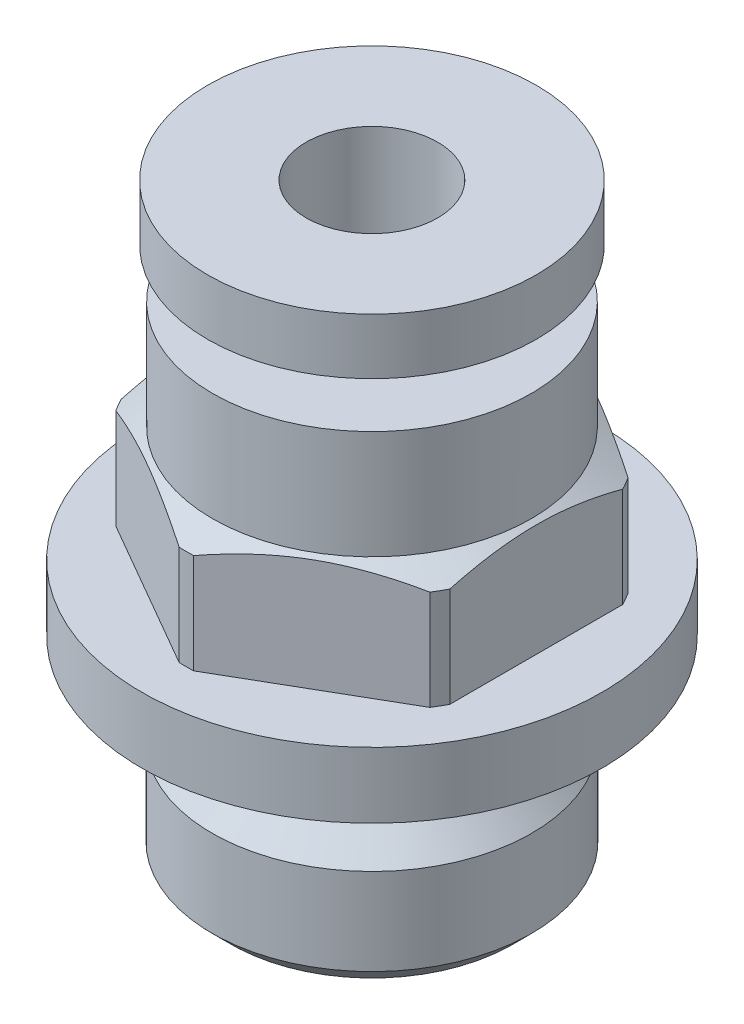
ISO-10303-21;
HEADER;
FILE_DESCRIPTION(('STEP AP214'),'2;1');
FILE_NAME('part.step','',(''),(''),'','','');
FILE_SCHEMA(('AUTOMOTIVE_DESIGN { 1 0 10303 214 1 1 1 1 }'));
ENDSEC;
DATA;
#1=APPLICATION_CONTEXT('core data for automotive mechanical design processes');
#2=APPLICATION_PROTOCOL_DEFINITION('international standard','automotive_design',2000,#1);
#3=PRODUCT_CONTEXT('',#1,'mechanical');
#4=PRODUCT('Part','Part','',(#3));
#5=PRODUCT_RELATED_PRODUCT_CATEGORY('part','',(#4));
#6=PRODUCT_DEFINITION_FORMATION('','',#4);
#7=PRODUCT_DEFINITION_CONTEXT('part definition',#1,'design');
#8=PRODUCT_DEFINITION('design','',#6,#7);
#9=PRODUCT_DEFINITION_SHAPE('','',#8);
#10=(LENGTH_UNIT() NAMED_UNIT(*) SI_UNIT(.MILLI.,.METRE.));
#11=(NAMED_UNIT(*) PLANE_ANGLE_UNIT() SI_UNIT($,.RADIAN.));
#12=(NAMED_UNIT(*) SI_UNIT($,.STERADIAN.) SOLID_ANGLE_UNIT());
#13=UNCERTAINTY_MEASURE_WITH_UNIT(LENGTH_MEASURE(1.E-05),#10,'distance_accuracy_value','');
#14=(GEOMETRIC_REPRESENTATION_CONTEXT(3) GLOBAL_UNCERTAINTY_ASSIGNED_CONTEXT((#13)) GLOBAL_UNIT_ASSIGNED_CONTEXT((#10,
#11,#12)) REPRESENTATION_CONTEXT('',''));
#15=CARTESIAN_POINT('',(0.,0.,0.));
#16=DIRECTION('',(0.,0.,1.));
#17=DIRECTION('',(1.,0.,0.));
#18=AXIS2_PLACEMENT_3D('',#15,#16,#17);
#19=CARTESIAN_POINT('',(0.,14.8,0.));
#20=DIRECTION('',(0.,1.,0.));
#21=DIRECTION('',(0.,0.,1.));
#22=AXIS2_PLACEMENT_3D('',#19,#20,#21);
#23=PLANE('',#22);
#24=CARTESIAN_POINT('',(0.,14.8,0.));
#25=DIRECTION('',(0.,1.,0.));
#26=DIRECTION('',(0.,0.,1.));
#27=AXIS2_PLACEMENT_3D('',#24,#25,#26);
#28=CIRCLE('',#27,4.85);
#29=CARTESIAN_POINT('',(0.,14.8,4.85));
#30=VERTEX_POINT('',#29);
#31=EDGE_CURVE('E549',#30,#30,#28,.T.);
#32=ORIENTED_EDGE('',*,*,#31,.T.);
#33=EDGE_LOOP('',(#32));
#34=FACE_BOUND('',#33,.T.);
#35=CARTESIAN_POINT('',(0.,14.8,0.));
#36=DIRECTION('',(0.,1.,0.));
#37=DIRECTION('',(0.,0.,1.));
#38=AXIS2_PLACEMENT_3D('',#35,#36,#37);
#39=CIRCLE('',#38,2.55);
#40=CARTESIAN_POINT('',(0.,14.8,2.55));
#41=VERTEX_POINT('',#40);
#42=EDGE_CURVE('E562',#41,#41,#39,.T.);
#43=ORIENTED_EDGE('',*,*,#42,.F.);
#44=EDGE_LOOP('',(#43));
#45=FACE_BOUND('',#44,.T.);
#46=ADVANCED_FACE('F44',(#34,#45),#23,.T.);
#47=CARTESIAN_POINT('',(0.,3.983,0.));
#48=DIRECTION('',(0.,-1.,0.));
#49=DIRECTION('',(0.,0.,-1.));
#50=AXIS2_PLACEMENT_3D('',#47,#48,#49);
#51=CONICAL_SURFACE('',#50,4.1,0.785398163397448);
#52=CARTESIAN_POINT('',(0.,3.219,0.));
#53=DIRECTION('',(0.,-1.,0.));
#54=DIRECTION('',(0.,0.,-1.));
#55=AXIS2_PLACEMENT_3D('',#52,#53,#54);
#56=CIRCLE('',#55,4.864);
#57=CARTESIAN_POINT('',(0.,3.219,-4.864));
#58=VERTEX_POINT('',#57);
#59=EDGE_CURVE('E559',#58,#58,#56,.T.);
#60=ORIENTED_EDGE('',*,*,#59,.F.);
#61=EDGE_LOOP('',(#60));
#62=FACE_BOUND('',#61,.T.);
#63=CARTESIAN_POINT('',(0.,3.983,0.));
#64=DIRECTION('',(0.,-1.,0.));
#65=DIRECTION('',(0.,0.,-1.));
#66=AXIS2_PLACEMENT_3D('',#63,#64,#65);
#67=CIRCLE('',#66,4.1);
#68=CARTESIAN_POINT('',(0.,3.983,-4.1));
#69=VERTEX_POINT('',#68);
#70=EDGE_CURVE('E442',#69,#69,#67,.F.);
#71=ORIENTED_EDGE('',*,*,#70,.F.);
#72=EDGE_LOOP('',(#71));
#73=FACE_BOUND('',#72,.T.);
#74=ADVANCED_FACE('F512',(#62,#73),#51,.T.);
#75=CARTESIAN_POINT('',(0.,3.983,0.));
#76=DIRECTION('',(0.,-1.,0.));
#77=DIRECTION('',(0.,0.,-1.));
#78=AXIS2_PLACEMENT_3D('',#75,#76,#77);
#79=CYLINDRICAL_SURFACE('',#78,4.1);
#80=ORIENTED_EDGE('',*,*,#70,.T.);
#81=EDGE_LOOP('',(#80));
#82=FACE_BOUND('',#81,.T.);
#83=CARTESIAN_POINT('',(0.,6.,0.));
#84=DIRECTION('',(0.,-1.,0.));
#85=DIRECTION('',(0.,0.,-1.));
#86=AXIS2_PLACEMENT_3D('',#83,#84,#85);
#87=CIRCLE('',#86,4.1);
#88=CARTESIAN_POINT('',(0.,6.,-4.1));
#89=VERTEX_POINT('',#88);
#90=EDGE_CURVE('E633',#89,#89,#87,.F.);
#91=ORIENTED_EDGE('',*,*,#90,.F.);
#92=EDGE_LOOP('',(#91));
#93=FACE_BOUND('',#92,.T.);
#94=ADVANCED_FACE('F519',(#82,#93),#79,.T.);
#95=CARTESIAN_POINT('',(0.,6.,0.));
#96=DIRECTION('',(0.,-1.,0.));
#97=DIRECTION('',(0.,0.,-1.));
#98=AXIS2_PLACEMENT_3D('',#95,#96,#97);
#99=TOROIDAL_SURFACE('',#98,4.99,0.89);
#100=ORIENTED_EDGE('',*,*,#90,.T.);
#101=EDGE_LOOP('',(#100));
#102=FACE_BOUND('',#101,.T.);
#103=CARTESIAN_POINT('',(0.,6.,0.));
#104=DIRECTION('',(0.,-1.,0.));
#105=DIRECTION('',(0.,0.,-1.));
#106=AXIS2_PLACEMENT_3D('',#103,#104,#105);
#107=CIRCLE('',#106,5.88);
#108=CARTESIAN_POINT('',(0.,6.,-5.88));
#109=VERTEX_POINT('',#108);
#110=EDGE_CURVE('E652',#109,#109,#107,.F.);
#111=ORIENTED_EDGE('',*,*,#110,.F.);
#112=EDGE_LOOP('',(#111));
#113=FACE_BOUND('',#112,.T.);
#114=ADVANCED_FACE('F635',(#102,#113),#99,.T.);
#115=CARTESIAN_POINT('',(-7.08400000000001,6.,7.084));
#116=DIRECTION('',(0.,-1.,0.));
#117=DIRECTION('',(0.,0.,-1.));
#118=AXIS2_PLACEMENT_3D('',#115,#116,#117);
#119=PLANE('',#118);
#120=ORIENTED_EDGE('',*,*,#110,.T.);
#121=EDGE_LOOP('',(#120));
#122=FACE_BOUND('',#121,.T.);
#123=CARTESIAN_POINT('',(0.,6.,0.));
#124=DIRECTION('',(0.,-1.,0.));
#125=DIRECTION('',(0.,0.,-1.));
#126=AXIS2_PLACEMENT_3D('',#123,#124,#125);
#127=CIRCLE('',#126,7.);
#128=CARTESIAN_POINT('',(0.,6.,-7.));
#129=VERTEX_POINT('',#128);
#130=EDGE_CURVE('E188',#129,#129,#127,.F.);
#131=ORIENTED_EDGE('',*,*,#130,.F.);
#132=EDGE_LOOP('',(#131));
#133=FACE_BOUND('',#132,.T.);
#134=ADVANCED_FACE('F639',(#122,#133),#119,.T.);
#135=CARTESIAN_POINT('',(0.,8.,0.));
#136=DIRECTION('',(0.,-1.,0.));
#137=DIRECTION('',(0.,0.,-1.));
#138=AXIS2_PLACEMENT_3D('',#135,#136,#137);
#139=CYLINDRICAL_SURFACE('',#138,5.65);
#140=DIRECTION('',(0.,1.,0.));
#141=VECTOR('',#140,1.);
#142=CARTESIAN_POINT('',(4.7785686296445,8.,3.01459480722991));
#143=LINE('',#142,#141);
#144=CARTESIAN_POINT('',(4.77856862964448,8.,3.01459480722992));
#145=VERTEX_POINT('',#144);
#146=CARTESIAN_POINT('',(4.77856862964449,11.0381197846483,3.01459480722992));
#147=VERTEX_POINT('',#146);
#148=EDGE_CURVE('E341',#145,#147,#143,.T.);
#149=ORIENTED_EDGE('',*,*,#148,.F.);
#150=CARTESIAN_POINT('',(0.,8.,0.));
#151=DIRECTION('',(0.,-1.,0.));
#152=DIRECTION('',(0.,0.,-1.));
#153=AXIS2_PLACEMENT_3D('',#150,#151,#152);
#154=CIRCLE('',#153,5.65);
#155=CARTESIAN_POINT('',(4.99999999999998,8.,2.63106442338458));
#156=VERTEX_POINT('',#155);
#157=EDGE_CURVE('E673',#145,#156,#154,.F.);
#158=ORIENTED_EDGE('',*,*,#157,.T.);
#159=DIRECTION('',(0.,1.,0.));
#160=VECTOR('',#159,1.);
#161=CARTESIAN_POINT('',(5.,8.,2.63106442338457));
#162=LINE('',#161,#160);
#163=CARTESIAN_POINT('',(5.,11.0381197846483,2.63106442338457));
#164=VERTEX_POINT('',#163);
#165=EDGE_CURVE('E401',#164,#156,#162,.F.);
#166=ORIENTED_EDGE('',*,*,#165,.F.);
#167=CARTESIAN_POINT('',(0.,11.0381197846483,0.));
#168=DIRECTION('',(0.,-1.,0.));
#169=DIRECTION('',(0.,0.,-1.));
#170=AXIS2_PLACEMENT_3D('',#167,#168,#169);
#171=CIRCLE('',#170,5.65);
#172=EDGE_CURVE('E658',#164,#147,#171,.T.);
#173=ORIENTED_EDGE('',*,*,#172,.T.);
#174=EDGE_LOOP('',(#149,#158,#166,#173));
#175=FACE_BOUND('',#174,.T.);
#176=ADVANCED_FACE('F859',(#175),#139,.T.);
#177=CARTESIAN_POINT('',(0.,8.,0.));
#178=DIRECTION('',(0.,-1.,0.));
#179=DIRECTION('',(0.,0.,-1.));
#180=AXIS2_PLACEMENT_3D('',#177,#178,#179);
#181=CYLINDRICAL_SURFACE('',#180,5.65);
#182=DIRECTION('',(0.,1.,0.));
#183=VECTOR('',#182,1.);
#184=CARTESIAN_POINT('',(-0.2214313703555,8.,5.64565923061448));
#185=LINE('',#184,#183);
#186=CARTESIAN_POINT('',(-0.221431370355493,8.,5.6456592306145));
#187=VERTEX_POINT('',#186);
#188=CARTESIAN_POINT('',(-0.2214313703555,11.0381197846483,5.64565923061448));
#189=VERTEX_POINT('',#188);
#190=EDGE_CURVE('E360',#187,#189,#185,.T.);
#191=ORIENTED_EDGE('',*,*,#190,.F.);
#192=CARTESIAN_POINT('',(0.,8.,0.));
#193=DIRECTION('',(0.,-1.,0.));
#194=DIRECTION('',(0.,0.,-1.));
#195=AXIS2_PLACEMENT_3D('',#192,#193,#194);
#196=CIRCLE('',#195,5.65);
#197=CARTESIAN_POINT('',(0.221431370355489,8.,5.6456592306145));
#198=VERTEX_POINT('',#197);
#199=EDGE_CURVE('E150',#187,#198,#196,.F.);
#200=ORIENTED_EDGE('',*,*,#199,.T.);
#201=DIRECTION('',(0.,1.,0.));
#202=VECTOR('',#201,1.);
#203=CARTESIAN_POINT('',(0.2214313703555,8.,5.64565923061448));
#204=LINE('',#203,#202);
#205=CARTESIAN_POINT('',(0.2214313703555,11.0381197846483,5.64565923061448));
#206=VERTEX_POINT('',#205);
#207=EDGE_CURVE('E384',#206,#198,#204,.F.);
#208=ORIENTED_EDGE('',*,*,#207,.F.);
#209=CARTESIAN_POINT('',(0.,11.0381197846483,0.));
#210=DIRECTION('',(0.,-1.,0.));
#211=DIRECTION('',(0.,0.,-1.));
#212=AXIS2_PLACEMENT_3D('',#209,#210,#211);
#213=CIRCLE('',#212,5.65);
#214=EDGE_CURVE('E678',#206,#189,#213,.T.);
#215=ORIENTED_EDGE('',*,*,#214,.T.);
#216=EDGE_LOOP('',(#191,#200,#208,#215));
#217=FACE_BOUND('',#216,.T.);
#218=ADVANCED_FACE('F851',(#217),#181,.T.);
#219=CARTESIAN_POINT('',(0.,8.,0.));
#220=DIRECTION('',(0.,-1.,0.));
#221=DIRECTION('',(0.,0.,-1.));
#222=AXIS2_PLACEMENT_3D('',#219,#220,#221);
#223=CYLINDRICAL_SURFACE('',#222,5.65);
#224=DIRECTION('',(0.,1.,0.));
#225=VECTOR('',#224,1.);
#226=CARTESIAN_POINT('',(-5.,8.,2.63106442338458));
#227=LINE('',#226,#225);
#228=CARTESIAN_POINT('',(-4.99999999999998,8.,2.63106442338459));
#229=VERTEX_POINT('',#228);
#230=CARTESIAN_POINT('',(-5.,11.0381197846483,2.63106442338458));
#231=VERTEX_POINT('',#230);
#232=EDGE_CURVE('E140',#229,#231,#227,.T.);
#233=ORIENTED_EDGE('',*,*,#232,.F.);
#234=CARTESIAN_POINT('',(0.,8.,0.));
#235=DIRECTION('',(0.,-1.,0.));
#236=DIRECTION('',(0.,0.,-1.));
#237=AXIS2_PLACEMENT_3D('',#234,#235,#236);
#238=CIRCLE('',#237,5.65);
#239=CARTESIAN_POINT('',(-4.77856862964448,8.,3.01459480722992));
#240=VERTEX_POINT('',#239);
#241=EDGE_CURVE('E149',#229,#240,#238,.F.);
#242=ORIENTED_EDGE('',*,*,#241,.T.);
#243=DIRECTION('',(0.,1.,0.));
#244=VECTOR('',#243,1.);
#245=CARTESIAN_POINT('',(-4.7785686296445,8.,3.01459480722991));
#246=LINE('',#245,#244);
#247=CARTESIAN_POINT('',(-4.7785686296445,11.0381197846483,3.01459480722991));
#248=VERTEX_POINT('',#247);
#249=EDGE_CURVE('E143',#248,#240,#246,.F.);
#250=ORIENTED_EDGE('',*,*,#249,.F.);
#251=CARTESIAN_POINT('',(0.,11.0381197846483,0.));
#252=DIRECTION('',(0.,-1.,0.));
#253=DIRECTION('',(0.,0.,-1.));
#254=AXIS2_PLACEMENT_3D('',#251,#252,#253);
#255=CIRCLE('',#254,5.65);
#256=EDGE_CURVE('E137',#248,#231,#255,.T.);
#257=ORIENTED_EDGE('',*,*,#256,.T.);
#258=EDGE_LOOP('',(#233,#242,#250,#257));
#259=FACE_BOUND('',#258,.T.);
#260=ADVANCED_FACE('F139',(#259),#223,.T.);
#261=CARTESIAN_POINT('',(0.,8.,0.));
#262=DIRECTION('',(0.,-1.,0.));
#263=DIRECTION('',(0.,0.,-1.));
#264=AXIS2_PLACEMENT_3D('',#261,#262,#263);
#265=CYLINDRICAL_SURFACE('',#264,5.65);
#266=DIRECTION('',(0.,1.,0.));
#267=VECTOR('',#266,1.);
#268=CARTESIAN_POINT('',(5.,8.,-2.63106442338468));
#269=LINE('',#268,#267);
#270=CARTESIAN_POINT('',(4.99999999999999,8.,-2.63106442338462));
#271=VERTEX_POINT('',#270);
#272=CARTESIAN_POINT('',(5.,11.0381197846483,-2.63106442338463));
#273=VERTEX_POINT('',#272);
#274=EDGE_CURVE('E382',#271,#273,#269,.T.);
#275=ORIENTED_EDGE('',*,*,#274,.F.);
#276=CARTESIAN_POINT('',(0.,8.,0.));
#277=DIRECTION('',(0.,-1.,0.));
#278=DIRECTION('',(0.,0.,-1.));
#279=AXIS2_PLACEMENT_3D('',#276,#277,#278);
#280=CIRCLE('',#279,5.65);
#281=CARTESIAN_POINT('',(4.77856862964449,8.,-3.01459480722991));
#282=VERTEX_POINT('',#281);
#283=EDGE_CURVE('E614',#271,#282,#280,.F.);
#284=ORIENTED_EDGE('',*,*,#283,.T.);
#285=DIRECTION('',(0.,1.,0.));
#286=VECTOR('',#285,1.);
#287=CARTESIAN_POINT('',(4.7785686296445,8.,-3.01459480722991));
#288=LINE('',#287,#286);
#289=CARTESIAN_POINT('',(4.7785686296445,11.0381197846483,-3.01459480722991));
#290=VERTEX_POINT('',#289);
#291=EDGE_CURVE('E159',#290,#282,#288,.F.);
#292=ORIENTED_EDGE('',*,*,#291,.F.);
#293=CARTESIAN_POINT('',(0.,11.0381197846483,0.));
#294=DIRECTION('',(0.,-1.,0.));
#295=DIRECTION('',(0.,0.,-1.));
#296=AXIS2_PLACEMENT_3D('',#293,#294,#295);
#297=CIRCLE('',#296,5.65);
#298=EDGE_CURVE('E367',#290,#273,#297,.T.);
#299=ORIENTED_EDGE('',*,*,#298,.T.);
#300=EDGE_LOOP('',(#275,#284,#292,#299));
#301=FACE_BOUND('',#300,.T.);
#302=ADVANCED_FACE('F502',(#301),#265,.T.);
#303=CARTESIAN_POINT('',(0.,6.,0.));
#304=DIRECTION('',(0.,-1.,0.));
#305=DIRECTION('',(0.,0.,-1.));
#306=AXIS2_PLACEMENT_3D('',#303,#304,#305);
#307=CYLINDRICAL_SURFACE('',#306,7.);
#308=ORIENTED_EDGE('',*,*,#130,.T.);
#309=EDGE_LOOP('',(#308));
#310=FACE_BOUND('',#309,.T.);
#311=CARTESIAN_POINT('',(0.,8.,0.));
#312=DIRECTION('',(0.,-1.,0.));
#313=DIRECTION('',(0.,0.,-1.));
#314=AXIS2_PLACEMENT_3D('',#311,#312,#313);
#315=CIRCLE('',#314,7.);
#316=CARTESIAN_POINT('',(0.,8.,-7.));
#317=VERTEX_POINT('',#316);
#318=EDGE_CURVE('E245',#317,#317,#315,.F.);
#319=ORIENTED_EDGE('',*,*,#318,.F.);
#320=EDGE_LOOP('',(#319));
#321=FACE_BOUND('',#320,.T.);
#322=ADVANCED_FACE('F500',(#310,#321),#307,.T.);
#323=CARTESIAN_POINT('',(5.,8.,2.63106442338457));
#324=DIRECTION('',(1.,0.,0.));
#325=DIRECTION('',(0.,0.,-1.));
#326=AXIS2_PLACEMENT_3D('',#323,#324,#325);
#327=PLANE('',#326);
#328=ORIENTED_EDGE('',*,*,#165,.T.);
#329=DIRECTION('',(0.,0.,1.));
#330=VECTOR('',#329,1.);
#331=CARTESIAN_POINT('',(4.99999999999995,8.,0.));
#332=LINE('',#331,#330);
#333=EDGE_CURVE('E617',#271,#156,#332,.T.);
#334=ORIENTED_EDGE('',*,*,#333,.F.);
#335=ORIENTED_EDGE('',*,*,#274,.T.);
#336=CARTESIAN_POINT('',(5.,11.0381197846483,2.63106442338459));
#337=CARTESIAN_POINT('',(5.,11.0716791860062,2.50623051639842));
#338=CARTESIAN_POINT('',(5.,11.1034995369539,2.38092848319098));
#339=CARTESIAN_POINT('',(5.,11.1632197411101,2.1293534946512));
#340=CARTESIAN_POINT('',(5.,11.1911183339445,2.00308024087693));
#341=CARTESIAN_POINT('',(5.,11.2683176792158,1.62247253746527));
#342=CARTESIAN_POINT('',(5.,11.3110132599278,1.366743952635));
#343=CARTESIAN_POINT('',(5.,11.3745835287302,0.858362458645548));
#344=CARTESIAN_POINT('',(5.,11.3959288809974,0.605770365116666));
#345=CARTESIAN_POINT('',(5.,11.4113633479822,0.226377542800942));
#346=CARTESIAN_POINT('',(5.,11.4137464704296,0.09987703038702));
#347=CARTESIAN_POINT('',(5.,11.4129666646811,-0.153103973622258));
#348=CARTESIAN_POINT('',(5.,11.4098040049261,-0.279584465890311));
#349=CARTESIAN_POINT('',(5.,11.3951850252362,-0.592406635178596));
#350=CARTESIAN_POINT('',(5.,11.3804991500097,-0.778603620671558));
#351=CARTESIAN_POINT('',(5.,11.3399204387064,-1.1498404996673));
#352=CARTESIAN_POINT('',(5.,11.3140220333512,-1.3348797717377));
#353=CARTESIAN_POINT('',(5.,11.251669364345,-1.70640713055064));
#354=CARTESIAN_POINT('',(5.,11.2150416208698,-1.89286560773726));
#355=CARTESIAN_POINT('',(5.,11.1328916246093,-2.26359687926452));
#356=CARTESIAN_POINT('',(5.,11.0873797434209,-2.44787195901238));
#357=CARTESIAN_POINT('',(5.,11.0381197846483,-2.63106442338462));
#358=B_SPLINE_CURVE_WITH_KNOTS('',3,(#336,#337,#338,#339,#340,#341,#342,#343,#344,#345,#346,
#347,#348,#349,#350,#351,#352,#353,#354,#355,#356,#357),.UNSPECIFIED.,.F.,.F.,(4,2,2,2,2,2,2,2,
2,2,4),(0.,0.387779560085222,0.775683461183912,1.55271447725653,2.31221118548422,
2.69167299650802,3.07111644037376,3.63105689212536,4.19127578668472,4.76110615321377,
5.33027521953319),.UNSPECIFIED.);
#359=EDGE_CURVE('E220',#164,#273,#358,.T.);
#360=ORIENTED_EDGE('',*,*,#359,.F.);
#361=EDGE_LOOP('',(#328,#334,#335,#360));
#362=FACE_BOUND('',#361,.T.);
#363=ADVANCED_FACE('F209',(#362),#327,.T.);
#364=CARTESIAN_POINT('',(0.2214313703555,8.,5.64565923061448));
#365=DIRECTION('',(0.499999999999999,0.,0.866025403784439));
#366=DIRECTION('',(0.866025403784439,0.,-0.499999999999999));
#367=AXIS2_PLACEMENT_3D('',#364,#365,#366);
#368=PLANE('',#367);
#369=ORIENTED_EDGE('',*,*,#207,.T.);
#370=CARTESIAN_POINT('',(4.77856862964446,8.,3.01459480722992));
#371=CARTESIAN_POINT('',(4.58868791050742,8.,3.12422249153761));
#372=CARTESIAN_POINT('',(4.39880719137038,8.,3.23385017584531));
#373=CARTESIAN_POINT('',(4.0190457530963,8.,3.45310554446069));
#374=CARTESIAN_POINT('',(3.82916503395926,8.,3.56273322876838));
#375=CARTESIAN_POINT('',(3.44940359568518,8.,3.78198859738376));
#376=CARTESIAN_POINT('',(3.25952287654814,8.,3.89161628169146));
#377=CARTESIAN_POINT('',(2.87976143827405,8.,4.11087165030684));
#378=CARTESIAN_POINT('',(2.68988071913701,8.,4.22049933461453));
#379=CARTESIAN_POINT('',(2.31011928086293,8.,4.43975470322992));
#380=CARTESIAN_POINT('',(2.12023856172589,8.,4.54938238753761));
#381=CARTESIAN_POINT('',(1.74047712345181,8.,4.76863775615299));
#382=CARTESIAN_POINT('',(1.55059640431477,8.,4.87826544046069));
#383=CARTESIAN_POINT('',(1.17083496604069,8.,5.09752080907607));
#384=CARTESIAN_POINT('',(0.980954246903649,8.,5.20714849338376));
#385=CARTESIAN_POINT('',(0.601192808629568,8.,5.42640386199915));
#386=CARTESIAN_POINT('',(0.411312089492528,8.,5.53603154630684));
#387=CARTESIAN_POINT('',(0.221431370355488,8.,5.64565923061453));
#388=B_SPLINE_CURVE_WITH_KNOTS('',3,(#370,#371,#372,#373,#374,#375,#376,#377,#378,#379,#380,
#381,#382,#383,#384,#385,#386,#387),.UNSPECIFIED.,.F.,.F.,(4,2,2,2,2,2,2,2,4),(0.,
0.657766105846144,1.31553221169228,1.97329831753843,2.63106442338457,3.28883052923072,
3.94659663507686,4.604362740923,5.26212884676915),.UNSPECIFIED.);
#389=EDGE_CURVE('E621',#145,#198,#388,.T.);
#390=ORIENTED_EDGE('',*,*,#389,.F.);
#391=ORIENTED_EDGE('',*,*,#148,.T.);
#392=CARTESIAN_POINT('',(0.221431370355484,11.0381197846483,5.64565923061449));
#393=CARTESIAN_POINT('',(0.329540705059166,11.0716791860062,5.58324227712141));
#394=CARTESIAN_POINT('',(0.438055448962651,11.1034995369539,5.52059126051769));
#395=CARTESIAN_POINT('',(0.655925779994884,11.1632197411101,5.39480376624779));
#396=CARTESIAN_POINT('',(0.765281625581917,11.1911183339445,5.33166713936066));
#397=CARTESIAN_POINT('',(1.09489756561247,11.2683176792158,5.14136328765483));
#398=CARTESIAN_POINT('',(1.31636501654933,11.3110132599278,5.01349899523969));
#399=CARTESIAN_POINT('',(1.75663630515808,11.3745835287302,4.75930824824497));
#400=CARTESIAN_POINT('',(1.97538747494919,11.3959288809974,4.63301220148053));
#401=CARTESIAN_POINT('',(2.30395129708808,11.4113633479822,4.44331579032267));
#402=CARTESIAN_POINT('',(2.41350395443029,11.4137464704296,4.38006553411571));
#403=CARTESIAN_POINT('',(2.63259193057721,11.4129666646811,4.25357503211107));
#404=CARTESIAN_POINT('',(2.74212724996451,11.4098040049261,4.19033478597704));
#405=CARTESIAN_POINT('',(3.01303919543512,11.3951850252362,4.0339237013329));
#406=CARTESIAN_POINT('',(3.1742905149801,11.3804991500097,3.94082520858642));
#407=CARTESIAN_POINT('',(3.49579108301206,11.3399204387064,3.75520676908856));
#408=CARTESIAN_POINT('',(3.65603979332281,11.3140220333512,3.66268713305336));
#409=CARTESIAN_POINT('',(3.97779192425575,11.251669364345,3.47692345364689));
#410=CARTESIAN_POINT('',(4.13926970225031,11.2150416208699,3.38369421505358));
#411=CARTESIAN_POINT('',(4.46033240137023,11.1328916246093,3.19832857928995));
#412=CARTESIAN_POINT('',(4.61991930171627,11.0873797434209,3.10619103941603));
#413=CARTESIAN_POINT('',(4.77856862964451,11.0381197846483,3.01459480722991));
#414=B_SPLINE_CURVE_WITH_KNOTS('',3,(#392,#393,#394,#395,#396,#397,#398,#399,#400,#401,#402,
#403,#404,#405,#406,#407,#408,#409,#410,#411,#412,#413),.UNSPECIFIED.,.F.,.F.,(4,2,2,2,2,2,2,2,
2,2,4),(0.,0.387779560085221,0.775683461183911,1.55271447725653,2.31221118548422,
2.69167299650802,3.07111644037376,3.63105689212535,4.1912757866847,4.76110615321374,
5.33027521953315),.UNSPECIFIED.);
#415=EDGE_CURVE('E172',#206,#147,#414,.T.);
#416=ORIENTED_EDGE('',*,*,#415,.F.);
#417=EDGE_LOOP('',(#369,#390,#391,#416));
#418=FACE_BOUND('',#417,.T.);
#419=ADVANCED_FACE('F204',(#418),#368,.T.);
#420=CARTESIAN_POINT('',(-4.7785686296445,8.,3.01459480722991));
#421=DIRECTION('',(-0.499999999999999,0.,0.866025403784439));
#422=DIRECTION('',(0.866025403784439,0.,0.499999999999999));
#423=AXIS2_PLACEMENT_3D('',#420,#421,#422);
#424=PLANE('',#423);
#425=ORIENTED_EDGE('',*,*,#249,.T.);
#426=CARTESIAN_POINT('',(-0.221431370355486,8.,5.64565923061453));
#427=CARTESIAN_POINT('',(-0.411312089492527,8.,5.53603154630684));
#428=CARTESIAN_POINT('',(-0.601192808629567,8.,5.42640386199915));
#429=CARTESIAN_POINT('',(-0.980954246903648,8.,5.20714849338376));
#430=CARTESIAN_POINT('',(-1.17083496604069,8.,5.09752080907607));
#431=CARTESIAN_POINT('',(-1.55059640431477,8.,4.87826544046069));
#432=CARTESIAN_POINT('',(-1.74047712345181,8.,4.76863775615299));
#433=CARTESIAN_POINT('',(-2.12023856172589,8.,4.54938238753761));
#434=CARTESIAN_POINT('',(-2.31011928086293,8.,4.43975470322992));
#435=CARTESIAN_POINT('',(-2.68988071913701,8.,4.22049933461453));
#436=CARTESIAN_POINT('',(-2.87976143827405,8.,4.11087165030684));
#437=CARTESIAN_POINT('',(-3.25952287654813,8.,3.89161628169146));
#438=CARTESIAN_POINT('',(-3.44940359568518,8.,3.78198859738376));
#439=CARTESIAN_POINT('',(-3.82916503395926,8.,3.56273322876838));
#440=CARTESIAN_POINT('',(-4.0190457530963,8.,3.45310554446069));
#441=CARTESIAN_POINT('',(-4.39880719137038,8.,3.23385017584531));
#442=CARTESIAN_POINT('',(-4.58868791050742,8.,3.12422249153761));
#443=CARTESIAN_POINT('',(-4.77856862964446,8.,3.01459480722992));
#444=B_SPLINE_CURVE_WITH_KNOTS('',3,(#426,#427,#428,#429,#430,#431,#432,#433,#434,#435,#436,
#437,#438,#439,#440,#441,#442,#443),.UNSPECIFIED.,.F.,.F.,(4,2,2,2,2,2,2,2,4),(0.,
0.657766105846144,1.31553221169229,1.97329831753843,2.63106442338457,3.28883052923072,
3.94659663507686,4.604362740923,5.26212884676915),.UNSPECIFIED.);
#445=EDGE_CURVE('E603',#187,#240,#444,.T.);
#446=ORIENTED_EDGE('',*,*,#445,.F.);
#447=ORIENTED_EDGE('',*,*,#190,.T.);
#448=CARTESIAN_POINT('',(-4.77856862964451,11.0381197846483,3.0145948072299));
#449=CARTESIAN_POINT('',(-4.67045929494083,11.0716791860062,3.07701176072299));
#450=CARTESIAN_POINT('',(-4.56194455103735,11.1034995369539,3.13966277732671));
#451=CARTESIAN_POINT('',(-4.34407422000511,11.1632197411101,3.2654502715966));
#452=CARTESIAN_POINT('',(-4.23471837441808,11.1911183339445,3.32858689848373));
#453=CARTESIAN_POINT('',(-3.90510243438753,11.2683176792158,3.51889075018956));
#454=CARTESIAN_POINT('',(-3.68363498345066,11.3110132599278,3.6467550426047));
#455=CARTESIAN_POINT('',(-3.24336369484191,11.3745835287302,3.90094578959942));
#456=CARTESIAN_POINT('',(-3.02461252505081,11.3959288809974,4.02724183636386));
#457=CARTESIAN_POINT('',(-2.69604870291191,11.4113633479822,4.21693824752173));
#458=CARTESIAN_POINT('',(-2.58649604556971,11.4137464704296,4.28018850372869));
#459=CARTESIAN_POINT('',(-2.36740806942278,11.4129666646811,4.40667900573333));
#460=CARTESIAN_POINT('',(-2.25787275003548,11.4098040049261,4.46991925186735));
#461=CARTESIAN_POINT('',(-1.98696080456487,11.3951850252362,4.62633033651149));
#462=CARTESIAN_POINT('',(-1.82570948501989,11.3804991500097,4.71942882925797));
#463=CARTESIAN_POINT('',(-1.50420891698793,11.3399204387064,4.90504726875584));
#464=CARTESIAN_POINT('',(-1.34396020667719,11.3140220333512,4.99756690479104));
#465=CARTESIAN_POINT('',(-1.02220807574424,11.251669364345,5.18333058419751));
#466=CARTESIAN_POINT('',(-0.860730297749674,11.2150416208699,5.27655982279082));
#467=CARTESIAN_POINT('',(-0.539667598629761,11.1328916246093,5.46192545855445));
#468=CARTESIAN_POINT('',(-0.380080698283719,11.0873797434209,5.55406299842837));
#469=CARTESIAN_POINT('',(-0.22143137035548,11.0381197846483,5.64565923061449));
#470=B_SPLINE_CURVE_WITH_KNOTS('',3,(#448,#449,#450,#451,#452,#453,#454,#455,#456,#457,#458,
#459,#460,#461,#462,#463,#464,#465,#466,#467,#468,#469),.UNSPECIFIED.,.F.,.F.,(4,2,2,2,2,2,2,2,
2,2,4),(0.,0.387779560085222,0.775683461183912,1.55271447725653,2.31221118548422,
2.69167299650802,3.07111644037376,3.63105689212535,4.19127578668471,4.76110615321375,
5.33027521953317),.UNSPECIFIED.);
#471=EDGE_CURVE('E166',#248,#189,#470,.T.);
#472=ORIENTED_EDGE('',*,*,#471,.F.);
#473=EDGE_LOOP('',(#425,#446,#447,#472));
#474=FACE_BOUND('',#473,.T.);
#475=ADVANCED_FACE('F199',(#474),#424,.T.);
#476=CARTESIAN_POINT('',(-5.,8.,-2.63106442338468));
#477=DIRECTION('',(-1.,0.,0.));
#478=DIRECTION('',(0.,0.,1.));
#479=AXIS2_PLACEMENT_3D('',#476,#477,#478);
#480=PLANE('',#479);
#481=DIRECTION('',(0.,1.,0.));
#482=VECTOR('',#481,1.);
#483=CARTESIAN_POINT('',(-5.,9.51905989232419,-2.63106442338457));
#484=LINE('',#483,#482);
#485=CARTESIAN_POINT('',(-4.99999999999997,8.,-2.63106442338459));
#486=VERTEX_POINT('',#485);
#487=CARTESIAN_POINT('',(-5.,11.0381197846483,-2.6310644233846));
#488=VERTEX_POINT('',#487);
#489=EDGE_CURVE('E131',#486,#488,#484,.T.);
#490=ORIENTED_EDGE('',*,*,#489,.F.);
#491=DIRECTION('',(0.,0.,-1.));
#492=VECTOR('',#491,1.);
#493=CARTESIAN_POINT('',(-4.99999999999995,8.,0.));
#494=LINE('',#493,#492);
#495=EDGE_CURVE('E157',#229,#486,#494,.T.);
#496=ORIENTED_EDGE('',*,*,#495,.F.);
#497=ORIENTED_EDGE('',*,*,#232,.T.);
#498=CARTESIAN_POINT('',(-5.,11.0381197846483,-2.63106442338464));
#499=CARTESIAN_POINT('',(-5.,11.0716791860062,-2.50623051639847));
#500=CARTESIAN_POINT('',(-5.,11.1034995369538,-2.38092848319103));
#501=CARTESIAN_POINT('',(-5.,11.1632197411101,-2.12935349465125));
#502=CARTESIAN_POINT('',(-5.,11.1911183339445,-2.00308024087698));
#503=CARTESIAN_POINT('',(-5.,11.2683176792158,-1.62247253746532));
#504=CARTESIAN_POINT('',(-5.,11.3110132599278,-1.36674395263504));
#505=CARTESIAN_POINT('',(-5.,11.3745835287302,-0.858362458645592));
#506=CARTESIAN_POINT('',(-5.,11.3959288809974,-0.605770365116709));
#507=CARTESIAN_POINT('',(-5.,11.4113633479822,-0.226377542800984));
#508=CARTESIAN_POINT('',(-5.,11.4137464704296,-0.0998770303870607));
#509=CARTESIAN_POINT('',(-5.,11.4129666646811,0.153103973622218));
#510=CARTESIAN_POINT('',(-5.,11.4098040049261,0.279584465890271));
#511=CARTESIAN_POINT('',(-5.,11.3951850252362,0.592406635178558));
#512=CARTESIAN_POINT('',(-5.,11.3804991500097,0.77860362067152));
#513=CARTESIAN_POINT('',(-5.,11.3399204387064,1.14984049966726));
#514=CARTESIAN_POINT('',(-5.,11.3140220333512,1.33487977173767));
#515=CARTESIAN_POINT('',(-5.,11.251669364345,1.70640713055061));
#516=CARTESIAN_POINT('',(-5.,11.2150416208699,1.89286560773723));
#517=CARTESIAN_POINT('',(-5.,11.1328916246093,2.26359687926449));
#518=CARTESIAN_POINT('',(-5.,11.087379743421,2.44787195901235));
#519=CARTESIAN_POINT('',(-5.,11.0381197846483,2.63106442338459));
#520=B_SPLINE_CURVE_WITH_KNOTS('',3,(#498,#499,#500,#501,#502,#503,#504,#505,#506,#507,#508,
#509,#510,#511,#512,#513,#514,#515,#516,#517,#518,#519),.UNSPECIFIED.,.F.,.F.,(4,2,2,2,2,2,2,2,
2,2,4),(0.,0.387779560085223,0.775683461183914,1.55271447725653,2.31221118548423,
2.69167299650803,3.07111644037377,3.63105689212537,4.19127578668474,4.76110615321379,
5.33027521953321),.UNSPECIFIED.);
#521=EDGE_CURVE('E154',#488,#231,#520,.T.);
#522=ORIENTED_EDGE('',*,*,#521,.F.);
#523=EDGE_LOOP('',(#490,#496,#497,#522));
#524=FACE_BOUND('',#523,.T.);
#525=ADVANCED_FACE('F153',(#524),#480,.T.);
#526=CARTESIAN_POINT('',(4.7785686296445,8.,-3.01459480722991));
#527=DIRECTION('',(0.499999999999999,0.,-0.866025403784439));
#528=DIRECTION('',(-0.866025403784439,0.,-0.499999999999999));
#529=AXIS2_PLACEMENT_3D('',#526,#527,#528);
#530=PLANE('',#529);
#531=ORIENTED_EDGE('',*,*,#291,.T.);
#532=CARTESIAN_POINT('',(0.221431370355489,8.,-5.64565923061453));
#533=CARTESIAN_POINT('',(0.411312089492528,8.,-5.53603154630683));
#534=CARTESIAN_POINT('',(0.601192808629568,8.,-5.42640386199914));
#535=CARTESIAN_POINT('',(0.980954246903649,8.,-5.20714849338376));
#536=CARTESIAN_POINT('',(1.17083496604069,8.,-5.09752080907607));
#537=CARTESIAN_POINT('',(1.55059640431477,8.,-4.87826544046069));
#538=CARTESIAN_POINT('',(1.74047712345181,8.,-4.76863775615299));
#539=CARTESIAN_POINT('',(2.12023856172589,8.,-4.54938238753761));
#540=CARTESIAN_POINT('',(2.31011928086293,8.,-4.43975470322992));
#541=CARTESIAN_POINT('',(2.68988071913701,8.,-4.22049933461453));
#542=CARTESIAN_POINT('',(2.87976143827406,8.,-4.11087165030684));
#543=CARTESIAN_POINT('',(3.25952287654814,8.,-3.89161628169146));
#544=CARTESIAN_POINT('',(3.44940359568518,8.,-3.78198859738376));
#545=CARTESIAN_POINT('',(3.82916503395926,8.,-3.56273322876838));
#546=CARTESIAN_POINT('',(4.0190457530963,8.,-3.45310554446069));
#547=CARTESIAN_POINT('',(4.39880719137038,8.,-3.2338501758453));
#548=CARTESIAN_POINT('',(4.58868791050742,8.,-3.12422249153761));
#549=CARTESIAN_POINT('',(4.77856862964446,8.,-3.01459480722992));
#550=B_SPLINE_CURVE_WITH_KNOTS('',3,(#532,#533,#534,#535,#536,#537,#538,#539,#540,#541,#542,
#543,#544,#545,#546,#547,#548,#549),.UNSPECIFIED.,.F.,.F.,(4,2,2,2,2,2,2,2,4),(0.,
0.657766105846142,1.31553221169229,1.97329831753843,2.63106442338457,3.28883052923072,
3.94659663507686,4.604362740923,5.26212884676914),.UNSPECIFIED.);
#551=CARTESIAN_POINT('',(0.221431236204499,8.,-5.64565923587609));
#552=VERTEX_POINT('',#551);
#553=EDGE_CURVE('E262',#552,#282,#550,.T.);
#554=ORIENTED_EDGE('',*,*,#553,.F.);
#555=DIRECTION('',(0.,-1.,0.));
#556=VECTOR('',#555,1.);
#557=CARTESIAN_POINT('',(0.221431370355518,9.51905989232415,-5.64565923061448));
#558=LINE('',#557,#556);
#559=CARTESIAN_POINT('',(0.221431370355504,11.0381197846483,-5.64565923061448));
#560=VERTEX_POINT('',#559);
#561=EDGE_CURVE('E570',#560,#552,#558,.T.);
#562=ORIENTED_EDGE('',*,*,#561,.F.);
#563=CARTESIAN_POINT('',(4.7785686296445,11.0381197846483,-3.01459480722991));
#564=CARTESIAN_POINT('',(4.67045929494082,11.0716791860062,-3.07701176072299));
#565=CARTESIAN_POINT('',(4.56194455103734,11.1034995369539,-3.13966277732671));
#566=CARTESIAN_POINT('',(4.3440742200051,11.1632197411101,-3.2654502715966));
#567=CARTESIAN_POINT('',(4.23471837441807,11.1911183339445,-3.32858689848374));
#568=CARTESIAN_POINT('',(3.90510243438752,11.2683176792158,-3.51889075018957));
#569=CARTESIAN_POINT('',(3.68363498345065,11.3110132599278,-3.6467550426047));
#570=CARTESIAN_POINT('',(3.24336369484191,11.3745835287302,-3.90094578959943));
#571=CARTESIAN_POINT('',(3.0246125250508,11.3959288809974,-4.02724183636387));
#572=CARTESIAN_POINT('',(2.69604870291191,11.4113633479822,-4.21693824752173));
#573=CARTESIAN_POINT('',(2.5864960455697,11.4137464704296,-4.28018850372869));
#574=CARTESIAN_POINT('',(2.36740806942277,11.4129666646811,-4.40667900573333));
#575=CARTESIAN_POINT('',(2.25787275003548,11.4098040049261,-4.46991925186736));
#576=CARTESIAN_POINT('',(1.98696080456487,11.3951850252362,-4.6263303365115));
#577=CARTESIAN_POINT('',(1.82570948501989,11.3804991500097,-4.71942882925797));
#578=CARTESIAN_POINT('',(1.50420891698793,11.3399204387064,-4.90504726875584));
#579=CARTESIAN_POINT('',(1.34396020667719,11.3140220333512,-4.99756690479104));
#580=CARTESIAN_POINT('',(1.02220807574425,11.251669364345,-5.18333058419751));
#581=CARTESIAN_POINT('',(0.86073029774968,11.2150416208699,-5.27655982279081));
#582=CARTESIAN_POINT('',(0.53966759862977,11.1328916246093,-5.46192545855444));
#583=CARTESIAN_POINT('',(0.38008069828373,11.087379743421,-5.55406299842836));
#584=CARTESIAN_POINT('',(0.221431370355491,11.0381197846483,-5.64565923061449));
#585=B_SPLINE_CURVE_WITH_KNOTS('',3,(#563,#564,#565,#566,#567,#568,#569,#570,#571,#572,#573,
#574,#575,#576,#577,#578,#579,#580,#581,#582,#583,#584),.UNSPECIFIED.,.F.,.F.,(4,2,2,2,2,2,2,2,
2,2,4),(0.,0.387779560085221,0.775683461183911,1.55271447725653,2.31221118548422,
2.69167299650802,3.07111644037376,3.63105689212535,4.1912757866847,4.76110615321373,
5.33027521953314),.UNSPECIFIED.);
#586=EDGE_CURVE('E238',#290,#560,#585,.T.);
#587=ORIENTED_EDGE('',*,*,#586,.F.);
#588=EDGE_LOOP('',(#531,#554,#562,#587));
#589=FACE_BOUND('',#588,.T.);
#590=ADVANCED_FACE('F198',(#589),#530,.T.);
#591=CARTESIAN_POINT('',(0.,8.,0.));
#592=DIRECTION('',(0.,-1.,0.));
#593=DIRECTION('',(0.,0.,-1.));
#594=AXIS2_PLACEMENT_3D('',#591,#592,#593);
#595=CYLINDRICAL_SURFACE('',#594,5.65);
#596=ORIENTED_EDGE('',*,*,#489,.T.);
#597=CARTESIAN_POINT('',(0.,11.0381197846483,0.));
#598=DIRECTION('',(0.,1.,0.));
#599=DIRECTION('',(0.,0.,-1.));
#600=AXIS2_PLACEMENT_3D('',#597,#598,#599);
#601=CIRCLE('',#600,5.65000000000005);
#602=CARTESIAN_POINT('',(-4.77856862964454,11.0381197846483,-3.01459480722989));
#603=VERTEX_POINT('',#602);
#604=EDGE_CURVE('E164',#603,#488,#601,.T.);
#605=ORIENTED_EDGE('',*,*,#604,.F.);
#606=DIRECTION('',(0.,1.,0.));
#607=VECTOR('',#606,1.);
#608=CARTESIAN_POINT('',(-4.7785686296445,8.,-3.01459480722991));
#609=LINE('',#608,#607);
#610=CARTESIAN_POINT('',(-4.77856862964449,8.,-3.01459480722991));
#611=VERTEX_POINT('',#610);
#612=EDGE_CURVE('E441',#611,#603,#609,.T.);
#613=ORIENTED_EDGE('',*,*,#612,.F.);
#614=CARTESIAN_POINT('',(-4.99999999999995,8.,-2.63106442338461));
#615=CARTESIAN_POINT('',(-4.99140199487317,8.,-2.64740385448729));
#616=CARTESIAN_POINT('',(-4.98272399740066,8.,-2.66370119431739));
#617=CARTESIAN_POINT('',(-4.96521126243737,8.,-2.6962053815611));
#618=CARTESIAN_POINT('',(-4.95637657082993,8.,-2.71241225369601));
#619=CARTESIAN_POINT('',(-4.93855044979073,8.,-2.74473550712404));
#620=CARTESIAN_POINT('',(-4.92955905080938,8.,-2.76085190521031));
#621=CARTESIAN_POINT('',(-4.91141953408201,8.,-2.79299422020201));
#622=CARTESIAN_POINT('',(-4.90227143148436,8.,-2.80902014565641));
#623=CARTESIAN_POINT('',(-4.88381852162287,8.,-2.84098152308401));
#624=CARTESIAN_POINT('',(-4.87451371435903,8.,-2.85691697505721));
#625=CARTESIAN_POINT('',(-4.85574741140345,8.,-2.88869741485133));
#626=CARTESIAN_POINT('',(-4.84628590073392,8.,-2.90454239382788));
#627=CARTESIAN_POINT('',(-4.82720620265188,8.,-2.93614189421278));
#628=CARTESIAN_POINT('',(-4.81758798547088,8.,-2.95189639764688));
#629=CARTESIAN_POINT('',(-4.7981949010701,8.,-2.98331496463669));
#630=CARTESIAN_POINT('',(-4.78841998949938,8.,-2.99897900081692));
#631=CARTESIAN_POINT('',(-4.77856862964446,8.,-3.01459480722992));
#632=B_SPLINE_CURVE_WITH_KNOTS('',3,(#614,#615,#616,#617,#618,#619,#620,#621,#622,#623,#624,
#625,#626,#627,#628,#629,#630,#631),.UNSPECIFIED.,.F.,.F.,(4,2,2,2,2,2,2,2,4),(0.,
0.0553904327434983,0.110764905358858,0.166128735332723,0.221487243218575,0.276845751104427,
0.332209581078297,0.387584053693664,0.442974486437172),.UNSPECIFIED.);
#633=EDGE_CURVE('E263',#486,#611,#632,.T.);
#634=ORIENTED_EDGE('',*,*,#633,.F.);
#635=EDGE_LOOP('',(#596,#605,#613,#634));
#636=FACE_BOUND('',#635,.T.);
#637=ADVANCED_FACE('F802',(#636),#595,.T.);
#638=CARTESIAN_POINT('',(0.,11.5,0.));
#639=DIRECTION('',(0.,-1.,0.));
#640=DIRECTION('',(0.,0.,-1.));
#641=AXIS2_PLACEMENT_3D('',#638,#639,#640);
#642=CONICAL_SURFACE('',#641,4.85,1.0471975511966);
#643=CARTESIAN_POINT('',(0.,11.0381197846483,0.));
#644=DIRECTION('',(0.,-1.,0.));
#645=DIRECTION('',(0.,0.,-1.));
#646=AXIS2_PLACEMENT_3D('',#643,#644,#645);
#647=CIRCLE('',#646,5.65);
#648=CARTESIAN_POINT('',(-0.221431370355455,11.0381197846483,-5.64565923061451));
#649=VERTEX_POINT('',#648);
#650=EDGE_CURVE('E421',#649,#560,#647,.T.);
#651=ORIENTED_EDGE('',*,*,#650,.F.);
#652=CARTESIAN_POINT('',(-4.77856862964451,11.0381197846483,-3.01459480722991));
#653=CARTESIAN_POINT('',(-4.67045929494082,11.0716791860062,-3.07701176072299));
#654=CARTESIAN_POINT('',(-4.56194455103734,11.1034995369539,-3.13966277732671));
#655=CARTESIAN_POINT('',(-4.3440742200051,11.1632197411101,-3.2654502715966));
#656=CARTESIAN_POINT('',(-4.23471837441807,11.1911183339445,-3.32858689848374));
#657=CARTESIAN_POINT('',(-3.90510243438752,11.2683176792158,-3.51889075018957));
#658=CARTESIAN_POINT('',(-3.68363498345066,11.3110132599278,-3.6467550426047));
#659=CARTESIAN_POINT('',(-3.24336369484191,11.3745835287302,-3.90094578959943));
#660=CARTESIAN_POINT('',(-3.0246125250508,11.3959288809974,-4.02724183636387));
#661=CARTESIAN_POINT('',(-2.69604870291191,11.4113633479822,-4.21693824752173));
#662=CARTESIAN_POINT('',(-2.5864960455697,11.4137464704296,-4.28018850372869));
#663=CARTESIAN_POINT('',(-2.36740806942278,11.4129666646811,-4.40667900573333));
#664=CARTESIAN_POINT('',(-2.25787275003548,11.4098040049261,-4.46991925186735));
#665=CARTESIAN_POINT('',(-1.98696080456487,11.3951850252362,-4.6263303365115));
#666=CARTESIAN_POINT('',(-1.82570948501989,11.3804991500097,-4.71942882925797));
#667=CARTESIAN_POINT('',(-1.50420891698794,11.3399204387064,-4.90504726875584));
#668=CARTESIAN_POINT('',(-1.34396020667719,11.3140220333512,-4.99756690479104));
#669=CARTESIAN_POINT('',(-1.02220807574425,11.251669364345,-5.1833305841975));
#670=CARTESIAN_POINT('',(-0.860730297749683,11.2150416208699,-5.27655982279081));
#671=CARTESIAN_POINT('',(-0.539667598629773,11.1328916246093,-5.46192545855444));
#672=CARTESIAN_POINT('',(-0.380080698283734,11.087379743421,-5.55406299842836));
#673=CARTESIAN_POINT('',(-0.221431370355496,11.0381197846483,-5.64565923061448));
#674=B_SPLINE_CURVE_WITH_KNOTS('',3,(#652,#653,#654,#655,#656,#657,#658,#659,#660,#661,#662,
#663,#664,#665,#666,#667,#668,#669,#670,#671,#672,#673),.UNSPECIFIED.,.F.,.F.,(4,2,2,2,2,2,2,2,
2,2,4),(0.,0.387779560085222,0.775683461183912,1.55271447725653,2.31221118548422,
2.69167299650802,3.07111644037376,3.63105689212534,4.19127578668469,4.76110615321373,
5.33027521953314),.UNSPECIFIED.);
#675=EDGE_CURVE('E432',#603,#649,#674,.T.);
#676=ORIENTED_EDGE('',*,*,#675,.F.);
#677=ORIENTED_EDGE('',*,*,#604,.T.);
#678=ORIENTED_EDGE('',*,*,#521,.T.);
#679=ORIENTED_EDGE('',*,*,#256,.F.);
#680=ORIENTED_EDGE('',*,*,#471,.T.);
#681=ORIENTED_EDGE('',*,*,#214,.F.);
#682=ORIENTED_EDGE('',*,*,#415,.T.);
#683=ORIENTED_EDGE('',*,*,#172,.F.);
#684=ORIENTED_EDGE('',*,*,#359,.T.);
#685=ORIENTED_EDGE('',*,*,#298,.F.);
#686=ORIENTED_EDGE('',*,*,#586,.T.);
#687=EDGE_LOOP('',(#651,#676,#677,#678,#679,#680,#681,#682,#683,#684,#685,#686));
#688=FACE_BOUND('',#687,.T.);
#689=CARTESIAN_POINT('',(0.,11.5,0.));
#690=DIRECTION('',(0.,1.,0.));
#691=DIRECTION('',(0.,0.,1.));
#692=AXIS2_PLACEMENT_3D('',#689,#690,#691);
#693=CIRCLE('',#692,4.85);
#694=CARTESIAN_POINT('',(0.,11.5,4.85));
#695=VERTEX_POINT('',#694);
#696=EDGE_CURVE('E552',#695,#695,#693,.T.);
#697=ORIENTED_EDGE('',*,*,#696,.F.);
#698=EDGE_LOOP('',(#697));
#699=FACE_BOUND('',#698,.T.);
#700=ADVANCED_FACE('F161',(#688,#699),#642,.T.);
#701=CARTESIAN_POINT('',(-7.08400000000001,8.,-7.084));
#702=DIRECTION('',(0.,1.,0.));
#703=DIRECTION('',(0.,0.,1.));
#704=AXIS2_PLACEMENT_3D('',#701,#702,#703);
#705=PLANE('',#704);
#706=ORIENTED_EDGE('',*,*,#241,.F.);
#707=ORIENTED_EDGE('',*,*,#495,.T.);
#708=ORIENTED_EDGE('',*,*,#633,.T.);
#709=DIRECTION('',(-0.866025403784439,0.,0.499999999999999));
#710=VECTOR('',#709,1.);
#711=CARTESIAN_POINT('',(-2.5,8.,-4.3301270189222));
#712=LINE('',#711,#710);
#713=CARTESIAN_POINT('',(-0.221431389729084,8.,-5.64565921942916));
#714=VERTEX_POINT('',#713);
#715=EDGE_CURVE('E440',#714,#611,#712,.T.);
#716=ORIENTED_EDGE('',*,*,#715,.F.);
#717=CARTESIAN_POINT('',(-0.221431370355485,8.,-5.64565923061453));
#718=CARTESIAN_POINT('',(-0.212209014817075,8.,-5.64602094625168));
#719=CARTESIAN_POINT('',(-0.202985773203068,8.,-5.64636007154619));
#720=CARTESIAN_POINT('',(-0.184538403484978,8.,-5.64699310253123));
#721=CARTESIAN_POINT('',(-0.175314275492614,8.,-5.6472870114774));
#722=CARTESIAN_POINT('',(-0.156865133012757,8.,-5.64782960993316));
#723=CARTESIAN_POINT('',(-0.147640118589122,8.,-5.64807830161395));
#724=CARTESIAN_POINT('',(-0.129189203309252,8.,-5.64853046687372));
#725=CARTESIAN_POINT('',(-0.119963302479627,8.,-5.64873394153855));
#726=CARTESIAN_POINT('',(-0.101510614419318,8.,-5.64909567376864));
#727=CARTESIAN_POINT('',(-0.092283827188633,8.,-5.6492539313339));
#728=CARTESIAN_POINT('',(-0.0738293663503724,8.,-5.64952523053427));
#729=CARTESIAN_POINT('',(-0.0646016927268302,8.,-5.64963827108331));
#730=CARTESIAN_POINT('',(-0.0461454591236609,8.,-5.64981913708699));
#731=CARTESIAN_POINT('',(-0.0369168991227493,8.,-5.6498869603696));
#732=CARTESIAN_POINT('',(-0.0184588927425825,8.,-5.64997739384431));
#733=CARTESIAN_POINT('',(-0.00922944634736664,8.,-5.65000000077889));
#734=CARTESIAN_POINT('',(0.,8.,-5.64999999999995));
#735=B_SPLINE_CURVE_WITH_KNOTS('',3,(#717,#718,#719,#720,#721,#722,#723,#724,#725,#726,#727,
#728,#729,#730,#731,#732,#733,#734),.UNSPECIFIED.,.F.,.F.,(4,2,2,2,2,2,2,2,4),(0.,
0.02768831142149,0.0553746283121337,0.0830596154357074,0.110743937651796,0.138428259867883,
0.166113246991452,0.193799563882085,0.221487875303562),.UNSPECIFIED.);
#736=CARTESIAN_POINT('',(0.,8.,-5.64999999999997));
#737=VERTEX_POINT('',#736);
#738=EDGE_CURVE('E61',#714,#737,#735,.T.);
#739=ORIENTED_EDGE('',*,*,#738,.T.);
#740=CARTESIAN_POINT('',(0.,8.,0.));
#741=DIRECTION('',(0.,-1.,0.));
#742=DIRECTION('',(0.,0.,-1.));
#743=AXIS2_PLACEMENT_3D('',#740,#741,#742);
#744=CIRCLE('',#743,5.65);
#745=EDGE_CURVE('E568',#552,#737,#744,.F.);
#746=ORIENTED_EDGE('',*,*,#745,.F.);
#747=ORIENTED_EDGE('',*,*,#553,.T.);
#748=ORIENTED_EDGE('',*,*,#283,.F.);
#749=ORIENTED_EDGE('',*,*,#333,.T.);
#750=ORIENTED_EDGE('',*,*,#157,.F.);
#751=ORIENTED_EDGE('',*,*,#389,.T.);
#752=ORIENTED_EDGE('',*,*,#199,.F.);
#753=ORIENTED_EDGE('',*,*,#445,.T.);
#754=EDGE_LOOP('',(#706,#707,#708,#716,#739,#746,#747,#748,#749,#750,#751,#752,#753));
#755=FACE_BOUND('',#754,.T.);
#756=ORIENTED_EDGE('',*,*,#318,.T.);
#757=EDGE_LOOP('',(#756));
#758=FACE_BOUND('',#757,.T.);
#759=ADVANCED_FACE('F283',(#755,#758),#705,.T.);
#760=CARTESIAN_POINT('',(-0.2214313703555,8.,-5.64565923061448));
#761=DIRECTION('',(-0.499999999999999,0.,-0.866025403784439));
#762=DIRECTION('',(-0.866025403784439,0.,0.499999999999999));
#763=AXIS2_PLACEMENT_3D('',#760,#761,#762);
#764=PLANE('',#763);
#765=DIRECTION('',(0.,1.,0.));
#766=VECTOR('',#765,1.);
#767=CARTESIAN_POINT('',(-0.221431370355499,9.51905989232415,-5.64565923061448));
#768=LINE('',#767,#766);
#769=EDGE_CURVE('E451',#714,#649,#768,.T.);
#770=ORIENTED_EDGE('',*,*,#769,.F.);
#771=ORIENTED_EDGE('',*,*,#715,.T.);
#772=ORIENTED_EDGE('',*,*,#612,.T.);
#773=ORIENTED_EDGE('',*,*,#675,.T.);
#774=EDGE_LOOP('',(#770,#771,#772,#773));
#775=FACE_BOUND('',#774,.T.);
#776=ADVANCED_FACE('F280',(#775),#764,.T.);
#777=CARTESIAN_POINT('',(0.,8.,0.));
#778=DIRECTION('',(0.,-1.,0.));
#779=DIRECTION('',(0.,0.,-1.));
#780=AXIS2_PLACEMENT_3D('',#777,#778,#779);
#781=CYLINDRICAL_SURFACE('',#780,5.65);
#782=ORIENTED_EDGE('',*,*,#738,.F.);
#783=ORIENTED_EDGE('',*,*,#769,.T.);
#784=ORIENTED_EDGE('',*,*,#650,.T.);
#785=ORIENTED_EDGE('',*,*,#561,.T.);
#786=ORIENTED_EDGE('',*,*,#745,.T.);
#787=EDGE_LOOP('',(#782,#783,#784,#785,#786));
#788=FACE_BOUND('',#787,.T.);
#789=ADVANCED_FACE('F515',(#788),#781,.T.);
#790=CARTESIAN_POINT('',(0.,0.,0.));
#791=DIRECTION('',(0.,1.,0.));
#792=DIRECTION('',(0.,0.,1.));
#793=AXIS2_PLACEMENT_3D('',#790,#791,#792);
#794=CYLINDRICAL_SURFACE('',#793,4.864);
#795=CARTESIAN_POINT('',(0.,0.580999999999999,0.));
#796=DIRECTION('',(0.,-1.,0.));
#797=DIRECTION('',(0.,0.,-1.));
#798=AXIS2_PLACEMENT_3D('',#795,#796,#797);
#799=CIRCLE('',#798,4.864);
#800=CARTESIAN_POINT('',(0.,0.580999999999999,-4.864));
#801=VERTEX_POINT('',#800);
#802=EDGE_CURVE('E12',#801,#801,#799,.F.);
#803=ORIENTED_EDGE('',*,*,#802,.T.);
#804=EDGE_LOOP('',(#803));
#805=FACE_BOUND('',#804,.T.);
#806=ORIENTED_EDGE('',*,*,#59,.T.);
#807=EDGE_LOOP('',(#806));
#808=FACE_BOUND('',#807,.T.);
#809=ADVANCED_FACE('F521',(#805,#808),#794,.T.);
#810=CARTESIAN_POINT('',(0.,0.,0.));
#811=DIRECTION('',(0.,-1.,0.));
#812=DIRECTION('',(0.,0.,-1.));
#813=AXIS2_PLACEMENT_3D('',#810,#811,#812);
#814=PLANE('',#813);
#815=CARTESIAN_POINT('',(0.,0.,0.));
#816=DIRECTION('',(0.,-1.,0.));
#817=DIRECTION('',(0.,0.,-1.));
#818=AXIS2_PLACEMENT_3D('',#815,#816,#817);
#819=CIRCLE('',#818,4.283);
#820=CARTESIAN_POINT('',(0.,0.,-4.283));
#821=VERTEX_POINT('',#820);
#822=EDGE_CURVE('E53',#821,#821,#819,.T.);
#823=ORIENTED_EDGE('',*,*,#822,.T.);
#824=EDGE_LOOP('',(#823));
#825=FACE_BOUND('',#824,.T.);
#826=CARTESIAN_POINT('',(0.,0.,0.));
#827=DIRECTION('',(0.,1.,0.));
#828=DIRECTION('',(0.,0.,1.));
#829=AXIS2_PLACEMENT_3D('',#826,#827,#828);
#830=CIRCLE('',#829,1.55000000000001);
#831=CARTESIAN_POINT('',(0.,0.,1.55000000000001));
#832=VERTEX_POINT('',#831);
#833=EDGE_CURVE('E1039',#832,#832,#830,.T.);
#834=ORIENTED_EDGE('',*,*,#833,.T.);
#835=EDGE_LOOP('',(#834));
#836=FACE_BOUND('',#835,.T.);
#837=ADVANCED_FACE('F531',(#825,#836),#814,.T.);
#838=CARTESIAN_POINT('',(0.,14.8,0.));
#839=DIRECTION('',(0.,-1.,0.));
#840=DIRECTION('',(0.,0.,-1.));
#841=AXIS2_PLACEMENT_3D('',#838,#839,#840);
#842=CYLINDRICAL_SURFACE('',#841,4.85);
#843=ORIENTED_EDGE('',*,*,#31,.F.);
#844=EDGE_LOOP('',(#843));
#845=FACE_BOUND('',#844,.T.);
#846=ORIENTED_EDGE('',*,*,#696,.T.);
#847=EDGE_LOOP('',(#846));
#848=FACE_BOUND('',#847,.T.);
#849=ADVANCED_FACE('F537',(#845,#848),#842,.T.);
#850=CARTESIAN_POINT('',(0.,16.3,0.));
#851=DIRECTION('',(0.,-1.,0.));
#852=DIRECTION('',(0.,0.,-1.));
#853=AXIS2_PLACEMENT_3D('',#850,#851,#852);
#854=CYLINDRICAL_SURFACE('',#853,2.55);
#855=CARTESIAN_POINT('',(0.,16.3,0.));
#856=DIRECTION('',(0.,1.,0.));
#857=DIRECTION('',(0.,0.,1.));
#858=AXIS2_PLACEMENT_3D('',#855,#856,#857);
#859=CIRCLE('',#858,2.55);
#860=CARTESIAN_POINT('',(0.,16.3,2.55));
#861=VERTEX_POINT('',#860);
#862=EDGE_CURVE('E554',#861,#861,#859,.T.);
#863=ORIENTED_EDGE('',*,*,#862,.F.);
#864=EDGE_LOOP('',(#863));
#865=FACE_BOUND('',#864,.T.);
#866=ORIENTED_EDGE('',*,*,#42,.T.);
#867=EDGE_LOOP('',(#866));
#868=FACE_BOUND('',#867,.T.);
#869=ADVANCED_FACE('F540',(#865,#868),#854,.T.);
#870=CARTESIAN_POINT('',(0.,16.3,0.));
#871=DIRECTION('',(0.,1.,0.));
#872=DIRECTION('',(0.,0.,1.));
#873=AXIS2_PLACEMENT_3D('',#870,#871,#872);
#874=PLANE('',#873);
#875=CARTESIAN_POINT('',(0.,16.3,0.));
#876=DIRECTION('',(0.,-1.,0.));
#877=DIRECTION('',(0.,0.,1.));
#878=AXIS2_PLACEMENT_3D('',#875,#876,#877);
#879=CIRCLE('',#878,5.);
#880=CARTESIAN_POINT('',(0.,16.3,5.));
#881=VERTEX_POINT('',#880);
#882=EDGE_CURVE('E1040',#881,#881,#879,.T.);
#883=ORIENTED_EDGE('',*,*,#882,.T.);
#884=EDGE_LOOP('',(#883));
#885=FACE_BOUND('',#884,.T.);
#886=ORIENTED_EDGE('',*,*,#862,.T.);
#887=EDGE_LOOP('',(#886));
#888=FACE_BOUND('',#887,.T.);
#889=ADVANCED_FACE('F545',(#885,#888),#874,.F.);
#890=CARTESIAN_POINT('',(0.,18.,0.));
#891=DIRECTION('',(0.,-1.,0.));
#892=DIRECTION('',(0.,0.,-1.));
#893=AXIS2_PLACEMENT_3D('',#890,#891,#892);
#894=CYLINDRICAL_SURFACE('',#893,5.);
#895=CARTESIAN_POINT('',(0.,18.,0.));
#896=DIRECTION('',(0.,-1.,0.));
#897=DIRECTION('',(0.,0.,1.));
#898=AXIS2_PLACEMENT_3D('',#895,#896,#897);
#899=CIRCLE('',#898,5.);
#900=CARTESIAN_POINT('',(0.,18.,5.));
#901=VERTEX_POINT('',#900);
#902=EDGE_CURVE('E1044',#901,#901,#899,.T.);
#903=ORIENTED_EDGE('',*,*,#902,.T.);
#904=EDGE_LOOP('',(#903));
#905=FACE_BOUND('',#904,.T.);
#906=ORIENTED_EDGE('',*,*,#882,.F.);
#907=EDGE_LOOP('',(#906));
#908=FACE_BOUND('',#907,.T.);
#909=ADVANCED_FACE('F960',(#905,#908),#894,.T.);
#910=CARTESIAN_POINT('',(0.,18.,0.));
#911=DIRECTION('',(0.,1.,0.));
#912=DIRECTION('',(0.,0.,1.));
#913=AXIS2_PLACEMENT_3D('',#910,#911,#912);
#914=PLANE('',#913);
#915=CARTESIAN_POINT('',(0.,18.,0.));
#916=DIRECTION('',(0.,1.,0.));
#917=DIRECTION('',(0.,0.,1.));
#918=AXIS2_PLACEMENT_3D('',#915,#916,#917);
#919=CIRCLE('',#918,1.99999999999999);
#920=CARTESIAN_POINT('',(0.,18.,1.99999999999999));
#921=VERTEX_POINT('',#920);
#922=EDGE_CURVE('E1063',#921,#921,#919,.T.);
#923=ORIENTED_EDGE('',*,*,#922,.F.);
#924=EDGE_LOOP('',(#923));
#925=FACE_BOUND('',#924,.T.);
#926=ORIENTED_EDGE('',*,*,#902,.F.);
#927=EDGE_LOOP('',(#926));
#928=FACE_BOUND('',#927,.T.);
#929=ADVANCED_FACE('F970',(#925,#928),#914,.T.);
#930=CARTESIAN_POINT('',(0.,18.,0.));
#931=DIRECTION('',(0.,1.,0.));
#932=DIRECTION('',(0.,0.,1.));
#933=AXIS2_PLACEMENT_3D('',#930,#931,#932);
#934=CYLINDRICAL_SURFACE('',#933,1.55000000000001);
#935=ORIENTED_EDGE('',*,*,#833,.F.);
#936=EDGE_LOOP('',(#935));
#937=FACE_BOUND('',#936,.T.);
#938=CARTESIAN_POINT('',(0.,8.,0.));
#939=DIRECTION('',(0.,1.,0.));
#940=DIRECTION('',(0.,0.,1.));
#941=AXIS2_PLACEMENT_3D('',#938,#939,#940);
#942=CIRCLE('',#941,1.55000000000001);
#943=CARTESIAN_POINT('',(0.,8.,1.55000000000001));
#944=VERTEX_POINT('',#943);
#945=EDGE_CURVE('E1041',#944,#944,#942,.T.);
#946=ORIENTED_EDGE('',*,*,#945,.T.);
#947=EDGE_LOOP('',(#946));
#948=FACE_BOUND('',#947,.T.);
#949=ADVANCED_FACE('F980',(#937,#948),#934,.F.);
#950=CARTESIAN_POINT('',(1.55000000000001,8.,0.));
#951=DIRECTION('',(0.,-1.,0.));
#952=DIRECTION('',(0.,0.,-1.));
#953=AXIS2_PLACEMENT_3D('',#950,#951,#952);
#954=PLANE('',#953);
#955=ORIENTED_EDGE('',*,*,#945,.F.);
#956=EDGE_LOOP('',(#955));
#957=FACE_BOUND('',#956,.T.);
#958=CARTESIAN_POINT('',(0.,8.,0.));
#959=DIRECTION('',(0.,1.,0.));
#960=DIRECTION('',(0.,0.,1.));
#961=AXIS2_PLACEMENT_3D('',#958,#959,#960);
#962=CIRCLE('',#961,1.99999999999999);
#963=CARTESIAN_POINT('',(0.,8.,1.99999999999999));
#964=VERTEX_POINT('',#963);
#965=EDGE_CURVE('E1047',#964,#964,#962,.T.);
#966=ORIENTED_EDGE('',*,*,#965,.T.);
#967=EDGE_LOOP('',(#966));
#968=FACE_BOUND('',#967,.T.);
#969=ADVANCED_FACE('F990',(#957,#968),#954,.F.);
#970=CARTESIAN_POINT('',(0.,18.,0.));
#971=DIRECTION('',(0.,1.,0.));
#972=DIRECTION('',(0.,0.,1.));
#973=AXIS2_PLACEMENT_3D('',#970,#971,#972);
#974=CYLINDRICAL_SURFACE('',#973,1.99999999999999);
#975=ORIENTED_EDGE('',*,*,#965,.F.);
#976=EDGE_LOOP('',(#975));
#977=FACE_BOUND('',#976,.T.);
#978=ORIENTED_EDGE('',*,*,#922,.T.);
#979=EDGE_LOOP('',(#978));
#980=FACE_BOUND('',#979,.T.);
#981=ADVANCED_FACE('F1000',(#977,#980),#974,.F.);
#982=CARTESIAN_POINT('',(0.,0.,0.));
#983=DIRECTION('',(0.,1.,0.));
#984=DIRECTION('',(0.,0.,1.));
#985=AXIS2_PLACEMENT_3D('',#982,#983,#984);
#986=CONICAL_SURFACE('',#985,4.283,0.785398163397447);
#987=ORIENTED_EDGE('',*,*,#802,.F.);
#988=EDGE_LOOP('',(#987));
#989=FACE_BOUND('',#988,.T.);
#990=ORIENTED_EDGE('',*,*,#822,.F.);
#991=EDGE_LOOP('',(#990));
#992=FACE_BOUND('',#991,.T.);
#993=ADVANCED_FACE('F46',(#989,#992),#986,.T.);
#994=CLOSED_SHELL('',(#46,#74,#94,#114,#134,#176,#218,#260,#302,#322,#363,#419,#475,#525,#590,
#637,#700,#759,#776,#789,#809,#837,#849,#869,#889,#909,#929,#949,#969,#981,#993));
#995=MANIFOLD_SOLID_BREP('B2',#994);
#996=ADVANCED_BREP_SHAPE_REPRESENTATION('',(#18,#995),#14);
#997=SHAPE_DEFINITION_REPRESENTATION(#9,#996);
ENDSEC;
END-ISO-10303-21;
